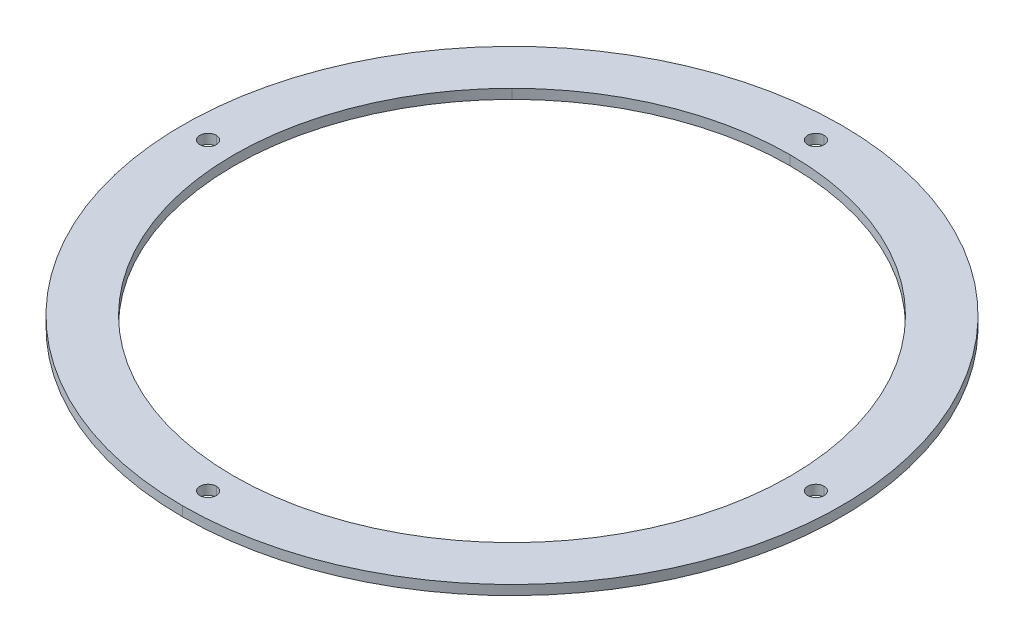
ISO-10303-21;
HEADER;
FILE_DESCRIPTION(('STEP AP214'),'2;1');
FILE_NAME('part.step','',(''),(''),'','','');
FILE_SCHEMA(('AUTOMOTIVE_DESIGN { 1 0 10303 214 1 1 1 1 }'));
ENDSEC;
DATA;
#1=APPLICATION_CONTEXT('core data for automotive mechanical design processes');
#2=APPLICATION_PROTOCOL_DEFINITION('international standard','automotive_design',2000,#1);
#3=PRODUCT_CONTEXT('',#1,'mechanical');
#4=PRODUCT('Part','Part','',(#3));
#5=PRODUCT_RELATED_PRODUCT_CATEGORY('part','',(#4));
#6=PRODUCT_DEFINITION_FORMATION('','',#4);
#7=PRODUCT_DEFINITION_CONTEXT('part definition',#1,'design');
#8=PRODUCT_DEFINITION('design','',#6,#7);
#9=PRODUCT_DEFINITION_SHAPE('','',#8);
#10=(LENGTH_UNIT() NAMED_UNIT(*) SI_UNIT(.MILLI.,.METRE.));
#11=(NAMED_UNIT(*) PLANE_ANGLE_UNIT() SI_UNIT($,.RADIAN.));
#12=(NAMED_UNIT(*) SI_UNIT($,.STERADIAN.) SOLID_ANGLE_UNIT());
#13=UNCERTAINTY_MEASURE_WITH_UNIT(LENGTH_MEASURE(1.E-05),#10,'distance_accuracy_value','');
#14=(GEOMETRIC_REPRESENTATION_CONTEXT(3) GLOBAL_UNCERTAINTY_ASSIGNED_CONTEXT((#13)) GLOBAL_UNIT_ASSIGNED_CONTEXT((#10,
#11,#12)) REPRESENTATION_CONTEXT('',''));
#15=CARTESIAN_POINT('',(0.,0.,0.));
#16=DIRECTION('',(0.,0.,1.));
#17=DIRECTION('',(1.,0.,0.));
#18=AXIS2_PLACEMENT_3D('',#15,#16,#17);
#19=CARTESIAN_POINT('',(0.,0.,0.));
#20=DIRECTION('',(0.,1.,0.));
#21=DIRECTION('',(1.,0.,0.));
#22=AXIS2_PLACEMENT_3D('',#19,#20,#21);
#23=PLANE('',#22);
#24=CARTESIAN_POINT('',(0.,0.,-94.75));
#25=DIRECTION('',(0.,1.,0.));
#26=DIRECTION('',(0.,0.,1.));
#27=AXIS2_PLACEMENT_3D('',#24,#25,#26);
#28=CIRCLE('',#27,2.5527);
#29=CARTESIAN_POINT('',(0.,0.,-97.3027));
#30=VERTEX_POINT('',#29);
#31=CARTESIAN_POINT('',(0.,0.,-92.1973));
#32=VERTEX_POINT('',#31);
#33=EDGE_CURVE('E162',#30,#32,#28,.T.);
#34=ORIENTED_EDGE('',*,*,#33,.T.);
#35=CARTESIAN_POINT('',(0.,0.,-94.75));
#36=DIRECTION('',(0.,1.,0.));
#37=DIRECTION('',(0.,0.,1.));
#38=AXIS2_PLACEMENT_3D('',#35,#36,#37);
#39=CIRCLE('',#38,2.5527);
#40=EDGE_CURVE('E11',#32,#30,#39,.T.);
#41=ORIENTED_EDGE('',*,*,#40,.T.);
#42=EDGE_LOOP('',(#34,#41));
#43=FACE_BOUND('',#42,.T.);
#44=CARTESIAN_POINT('',(-0.001,0.,-0.001));
#45=DIRECTION('',(0.,1.,0.));
#46=DIRECTION('',(0.,0.,1.));
#47=AXIS2_PLACEMENT_3D('',#44,#45,#46);
#48=CIRCLE('',#47,86.75);
#49=CARTESIAN_POINT('',(-61.3420132658952,0.,-61.3430132658953));
#50=VERTEX_POINT('',#49);
#51=CARTESIAN_POINT('',(-61.3420132658953,0.,61.3410132658952));
#52=VERTEX_POINT('',#51);
#53=EDGE_CURVE('E275',#50,#52,#48,.T.);
#54=ORIENTED_EDGE('',*,*,#53,.T.);
#55=CARTESIAN_POINT('',(0.,0.,0.));
#56=DIRECTION('',(0.,1.,0.));
#57=DIRECTION('',(0.,0.,1.));
#58=AXIS2_PLACEMENT_3D('',#55,#56,#57);
#59=CIRCLE('',#58,86.75);
#60=CARTESIAN_POINT('',(61.3420132658951,0.,61.3410132658953));
#61=VERTEX_POINT('',#60);
#62=EDGE_CURVE('E48',#52,#61,#59,.T.);
#63=ORIENTED_EDGE('',*,*,#62,.T.);
#64=CARTESIAN_POINT('',(0.001,0.,-0.001));
#65=DIRECTION('',(0.,1.,0.));
#66=DIRECTION('',(0.,0.,1.));
#67=AXIS2_PLACEMENT_3D('',#64,#65,#66);
#68=CIRCLE('',#67,86.75);
#69=CARTESIAN_POINT('',(61.3420132658953,0.,-61.3430132658951));
#70=VERTEX_POINT('',#69);
#71=EDGE_CURVE('E301',#61,#70,#68,.T.);
#72=ORIENTED_EDGE('',*,*,#71,.T.);
#73=CARTESIAN_POINT('',(0.,0.,-0.002));
#74=DIRECTION('',(0.,1.,0.));
#75=DIRECTION('',(0.,0.,1.));
#76=AXIS2_PLACEMENT_3D('',#73,#74,#75);
#77=CIRCLE('',#76,86.75);
#78=CARTESIAN_POINT('',(0.,0.,-86.752));
#79=VERTEX_POINT('',#78);
#80=EDGE_CURVE('E267',#70,#79,#77,.T.);
#81=ORIENTED_EDGE('',*,*,#80,.T.);
#82=CARTESIAN_POINT('',(0.,0.,-0.002));
#83=DIRECTION('',(0.,1.,0.));
#84=DIRECTION('',(0.,0.,1.));
#85=AXIS2_PLACEMENT_3D('',#82,#83,#84);
#86=CIRCLE('',#85,86.75);
#87=EDGE_CURVE('E296',#79,#50,#86,.T.);
#88=ORIENTED_EDGE('',*,*,#87,.T.);
#89=EDGE_LOOP('',(#54,#63,#72,#81,#88));
#90=FACE_BOUND('',#89,.T.);
#91=CARTESIAN_POINT('',(94.75,0.,0.));
#92=DIRECTION('',(0.,1.,0.));
#93=DIRECTION('',(0.,0.,1.));
#94=AXIS2_PLACEMENT_3D('',#91,#92,#93);
#95=CIRCLE('',#94,2.5527);
#96=CARTESIAN_POINT('',(94.75,0.,-2.5527));
#97=VERTEX_POINT('',#96);
#98=CARTESIAN_POINT('',(94.75,0.,2.5527));
#99=VERTEX_POINT('',#98);
#100=EDGE_CURVE('E251',#97,#99,#95,.T.);
#101=ORIENTED_EDGE('',*,*,#100,.T.);
#102=CARTESIAN_POINT('',(94.75,0.,0.));
#103=DIRECTION('',(0.,1.,0.));
#104=DIRECTION('',(0.,0.,1.));
#105=AXIS2_PLACEMENT_3D('',#102,#103,#104);
#106=CIRCLE('',#105,2.5527);
#107=EDGE_CURVE('E314',#99,#97,#106,.T.);
#108=ORIENTED_EDGE('',*,*,#107,.T.);
#109=EDGE_LOOP('',(#101,#108));
#110=FACE_BOUND('',#109,.T.);
#111=CARTESIAN_POINT('',(0.,0.,94.75));
#112=DIRECTION('',(0.,1.,0.));
#113=DIRECTION('',(0.,0.,1.));
#114=AXIS2_PLACEMENT_3D('',#111,#112,#113);
#115=CIRCLE('',#114,2.5527);
#116=CARTESIAN_POINT('',(0.,0.,92.1973));
#117=VERTEX_POINT('',#116);
#118=CARTESIAN_POINT('',(0.,0.,97.3027));
#119=VERTEX_POINT('',#118);
#120=EDGE_CURVE('E220',#117,#119,#115,.T.);
#121=ORIENTED_EDGE('',*,*,#120,.T.);
#122=CARTESIAN_POINT('',(0.,0.,94.75));
#123=DIRECTION('',(0.,1.,0.));
#124=DIRECTION('',(0.,0.,1.));
#125=AXIS2_PLACEMENT_3D('',#122,#123,#124);
#126=CIRCLE('',#125,2.5527);
#127=EDGE_CURVE('E234',#119,#117,#126,.T.);
#128=ORIENTED_EDGE('',*,*,#127,.T.);
#129=EDGE_LOOP('',(#121,#128));
#130=FACE_BOUND('',#129,.T.);
#131=CARTESIAN_POINT('',(-94.75,0.,0.));
#132=DIRECTION('',(0.,1.,0.));
#133=DIRECTION('',(0.,0.,1.));
#134=AXIS2_PLACEMENT_3D('',#131,#132,#133);
#135=CIRCLE('',#134,2.5527);
#136=CARTESIAN_POINT('',(-94.75,0.,-2.55270000000004));
#137=VERTEX_POINT('',#136);
#138=CARTESIAN_POINT('',(-94.75,0.,2.5527));
#139=VERTEX_POINT('',#138);
#140=EDGE_CURVE('E227',#137,#139,#135,.T.);
#141=ORIENTED_EDGE('',*,*,#140,.T.);
#142=CARTESIAN_POINT('',(-94.75,0.,0.));
#143=DIRECTION('',(0.,1.,0.));
#144=DIRECTION('',(0.,0.,1.));
#145=AXIS2_PLACEMENT_3D('',#142,#143,#144);
#146=CIRCLE('',#145,2.5527);
#147=EDGE_CURVE('E210',#139,#137,#146,.T.);
#148=ORIENTED_EDGE('',*,*,#147,.T.);
#149=EDGE_LOOP('',(#141,#148));
#150=FACE_BOUND('',#149,.T.);
#151=CARTESIAN_POINT('',(0.,0.,0.));
#152=DIRECTION('',(0.,1.,0.));
#153=DIRECTION('',(0.,0.,1.));
#154=AXIS2_PLACEMENT_3D('',#151,#152,#153);
#155=CIRCLE('',#154,102.75);
#156=CARTESIAN_POINT('',(0.,0.,-102.75));
#157=VERTEX_POINT('',#156);
#158=CARTESIAN_POINT('',(0.,0.,102.75));
#159=VERTEX_POINT('',#158);
#160=EDGE_CURVE('E289',#157,#159,#155,.T.);
#161=ORIENTED_EDGE('',*,*,#160,.F.);
#162=CARTESIAN_POINT('',(0.,0.,0.));
#163=DIRECTION('',(0.,1.,0.));
#164=DIRECTION('',(0.,0.,1.));
#165=AXIS2_PLACEMENT_3D('',#162,#163,#164);
#166=CIRCLE('',#165,102.75);
#167=EDGE_CURVE('E190',#159,#157,#166,.T.);
#168=ORIENTED_EDGE('',*,*,#167,.F.);
#169=EDGE_LOOP('',(#161,#168));
#170=FACE_BOUND('',#169,.T.);
#171=ADVANCED_FACE('F16',(#43,#90,#110,#130,#150,#170),#23,.F.);
#172=CARTESIAN_POINT('',(0.,2.9972,0.));
#173=DIRECTION('',(0.,1.,0.));
#174=DIRECTION('',(1.,0.,0.));
#175=AXIS2_PLACEMENT_3D('',#172,#173,#174);
#176=PLANE('',#175);
#177=CARTESIAN_POINT('',(0.,2.9972,-94.75));
#178=DIRECTION('',(0.,1.,0.));
#179=DIRECTION('',(0.,0.,1.));
#180=AXIS2_PLACEMENT_3D('',#177,#178,#179);
#181=CIRCLE('',#180,2.5527);
#182=CARTESIAN_POINT('',(0.,2.9972,-97.3027));
#183=VERTEX_POINT('',#182);
#184=CARTESIAN_POINT('',(0.,2.9972,-92.1973));
#185=VERTEX_POINT('',#184);
#186=EDGE_CURVE('E183',#183,#185,#181,.T.);
#187=ORIENTED_EDGE('',*,*,#186,.F.);
#188=CARTESIAN_POINT('',(0.,2.9972,-94.75));
#189=DIRECTION('',(0.,1.,0.));
#190=DIRECTION('',(0.,0.,1.));
#191=AXIS2_PLACEMENT_3D('',#188,#189,#190);
#192=CIRCLE('',#191,2.5527);
#193=EDGE_CURVE('E24',#185,#183,#192,.T.);
#194=ORIENTED_EDGE('',*,*,#193,.F.);
#195=EDGE_LOOP('',(#187,#194));
#196=FACE_BOUND('',#195,.T.);
#197=CARTESIAN_POINT('',(-0.001,2.9972,-0.001));
#198=DIRECTION('',(0.,1.,0.));
#199=DIRECTION('',(0.,0.,1.));
#200=AXIS2_PLACEMENT_3D('',#197,#198,#199);
#201=CIRCLE('',#200,86.75);
#202=CARTESIAN_POINT('',(-61.3420132658952,2.9972,-61.3430132658953));
#203=VERTEX_POINT('',#202);
#204=CARTESIAN_POINT('',(-61.3420132658953,2.9972,61.3410132658952));
#205=VERTEX_POINT('',#204);
#206=EDGE_CURVE('E282',#203,#205,#201,.T.);
#207=ORIENTED_EDGE('',*,*,#206,.F.);
#208=CARTESIAN_POINT('',(0.,2.9972,-0.002));
#209=DIRECTION('',(0.,1.,0.));
#210=DIRECTION('',(0.,0.,1.));
#211=AXIS2_PLACEMENT_3D('',#208,#209,#210);
#212=CIRCLE('',#211,86.75);
#213=CARTESIAN_POINT('',(0.,2.9972,-86.752));
#214=VERTEX_POINT('',#213);
#215=EDGE_CURVE('E293',#214,#203,#212,.T.);
#216=ORIENTED_EDGE('',*,*,#215,.F.);
#217=CARTESIAN_POINT('',(0.,2.9972,-0.002));
#218=DIRECTION('',(0.,1.,0.));
#219=DIRECTION('',(0.,0.,1.));
#220=AXIS2_PLACEMENT_3D('',#217,#218,#219);
#221=CIRCLE('',#220,86.75);
#222=CARTESIAN_POINT('',(61.3420132658953,2.9972,-61.3430132658951));
#223=VERTEX_POINT('',#222);
#224=EDGE_CURVE('E259',#223,#214,#221,.T.);
#225=ORIENTED_EDGE('',*,*,#224,.F.);
#226=CARTESIAN_POINT('',(0.001,2.9972,-0.001));
#227=DIRECTION('',(0.,1.,0.));
#228=DIRECTION('',(0.,0.,1.));
#229=AXIS2_PLACEMENT_3D('',#226,#227,#228);
#230=CIRCLE('',#229,86.75);
#231=CARTESIAN_POINT('',(61.3420132658951,2.9972,61.3410132658953));
#232=VERTEX_POINT('',#231);
#233=EDGE_CURVE('E307',#232,#223,#230,.T.);
#234=ORIENTED_EDGE('',*,*,#233,.F.);
#235=CARTESIAN_POINT('',(0.,2.9972,0.));
#236=DIRECTION('',(0.,1.,0.));
#237=DIRECTION('',(0.,0.,1.));
#238=AXIS2_PLACEMENT_3D('',#235,#236,#237);
#239=CIRCLE('',#238,86.75);
#240=EDGE_CURVE('E37',#205,#232,#239,.T.);
#241=ORIENTED_EDGE('',*,*,#240,.F.);
#242=EDGE_LOOP('',(#207,#216,#225,#234,#241));
#243=FACE_BOUND('',#242,.T.);
#244=CARTESIAN_POINT('',(94.75,2.9972,0.));
#245=DIRECTION('',(0.,1.,0.));
#246=DIRECTION('',(0.,0.,1.));
#247=AXIS2_PLACEMENT_3D('',#244,#245,#246);
#248=CIRCLE('',#247,2.5527);
#249=CARTESIAN_POINT('',(94.75,2.9972,-2.5527));
#250=VERTEX_POINT('',#249);
#251=CARTESIAN_POINT('',(94.75,2.9972,2.5527));
#252=VERTEX_POINT('',#251);
#253=EDGE_CURVE('E219',#250,#252,#248,.T.);
#254=ORIENTED_EDGE('',*,*,#253,.F.);
#255=CARTESIAN_POINT('',(94.75,2.9972,0.));
#256=DIRECTION('',(0.,1.,0.));
#257=DIRECTION('',(0.,0.,1.));
#258=AXIS2_PLACEMENT_3D('',#255,#256,#257);
#259=CIRCLE('',#258,2.5527);
#260=EDGE_CURVE('E317',#252,#250,#259,.T.);
#261=ORIENTED_EDGE('',*,*,#260,.F.);
#262=EDGE_LOOP('',(#254,#261));
#263=FACE_BOUND('',#262,.T.);
#264=CARTESIAN_POINT('',(0.,2.9972,94.75));
#265=DIRECTION('',(0.,1.,0.));
#266=DIRECTION('',(0.,0.,1.));
#267=AXIS2_PLACEMENT_3D('',#264,#265,#266);
#268=CIRCLE('',#267,2.5527);
#269=CARTESIAN_POINT('',(0.,2.9972,92.1973));
#270=VERTEX_POINT('',#269);
#271=CARTESIAN_POINT('',(0.,2.9972,97.3027));
#272=VERTEX_POINT('',#271);
#273=EDGE_CURVE('E201',#270,#272,#268,.T.);
#274=ORIENTED_EDGE('',*,*,#273,.F.);
#275=CARTESIAN_POINT('',(0.,2.9972,94.75));
#276=DIRECTION('',(0.,1.,0.));
#277=DIRECTION('',(0.,0.,1.));
#278=AXIS2_PLACEMENT_3D('',#275,#276,#277);
#279=CIRCLE('',#278,2.5527);
#280=EDGE_CURVE('E237',#272,#270,#279,.T.);
#281=ORIENTED_EDGE('',*,*,#280,.F.);
#282=EDGE_LOOP('',(#274,#281));
#283=FACE_BOUND('',#282,.T.);
#284=CARTESIAN_POINT('',(-94.75,2.9972,0.));
#285=DIRECTION('',(0.,1.,0.));
#286=DIRECTION('',(0.,0.,1.));
#287=AXIS2_PLACEMENT_3D('',#284,#285,#286);
#288=CIRCLE('',#287,2.5527);
#289=CARTESIAN_POINT('',(-94.75,2.9972,-2.55270000000004));
#290=VERTEX_POINT('',#289);
#291=CARTESIAN_POINT('',(-94.75,2.9972,2.5527));
#292=VERTEX_POINT('',#291);
#293=EDGE_CURVE('E192',#290,#292,#288,.T.);
#294=ORIENTED_EDGE('',*,*,#293,.F.);
#295=CARTESIAN_POINT('',(-94.75,2.9972,0.));
#296=DIRECTION('',(0.,1.,0.));
#297=DIRECTION('',(0.,0.,1.));
#298=AXIS2_PLACEMENT_3D('',#295,#296,#297);
#299=CIRCLE('',#298,2.5527);
#300=EDGE_CURVE('E214',#292,#290,#299,.T.);
#301=ORIENTED_EDGE('',*,*,#300,.F.);
#302=EDGE_LOOP('',(#294,#301));
#303=FACE_BOUND('',#302,.T.);
#304=CARTESIAN_POINT('',(0.,2.9972,0.));
#305=DIRECTION('',(0.,1.,0.));
#306=DIRECTION('',(0.,0.,1.));
#307=AXIS2_PLACEMENT_3D('',#304,#305,#306);
#308=CIRCLE('',#307,102.75);
#309=CARTESIAN_POINT('',(0.,2.9972,-102.75));
#310=VERTEX_POINT('',#309);
#311=CARTESIAN_POINT('',(0.,2.9972,102.75));
#312=VERTEX_POINT('',#311);
#313=EDGE_CURVE('E213',#310,#312,#308,.T.);
#314=ORIENTED_EDGE('',*,*,#313,.T.);
#315=CARTESIAN_POINT('',(0.,2.9972,0.));
#316=DIRECTION('',(0.,1.,0.));
#317=DIRECTION('',(0.,0.,1.));
#318=AXIS2_PLACEMENT_3D('',#315,#316,#317);
#319=CIRCLE('',#318,102.75);
#320=EDGE_CURVE('E173',#312,#310,#319,.T.);
#321=ORIENTED_EDGE('',*,*,#320,.T.);
#322=EDGE_LOOP('',(#314,#321));
#323=FACE_BOUND('',#322,.T.);
#324=ADVANCED_FACE('F336',(#196,#243,#263,#283,#303,#323),#176,.T.);
#325=CARTESIAN_POINT('',(0.,2.9972,-94.75));
#326=DIRECTION('',(0.,-1.,0.));
#327=DIRECTION('',(0.,0.,-1.));
#328=AXIS2_PLACEMENT_3D('',#325,#326,#327);
#329=CYLINDRICAL_SURFACE('',#328,2.5527);
#330=DIRECTION('',(0.,-1.,0.));
#331=VECTOR('',#330,1.);
#332=CARTESIAN_POINT('',(0.,2.9972,-92.1973));
#333=LINE('',#332,#331);
#334=EDGE_CURVE('E176',#185,#32,#333,.T.);
#335=ORIENTED_EDGE('',*,*,#334,.F.);
#336=ORIENTED_EDGE('',*,*,#193,.T.);
#337=DIRECTION('',(0.,-1.,0.));
#338=VECTOR('',#337,1.);
#339=CARTESIAN_POINT('',(0.,2.9972,-97.3027));
#340=LINE('',#339,#338);
#341=EDGE_CURVE('E167',#183,#30,#340,.T.);
#342=ORIENTED_EDGE('',*,*,#341,.T.);
#343=ORIENTED_EDGE('',*,*,#40,.F.);
#344=EDGE_LOOP('',(#335,#336,#342,#343));
#345=FACE_BOUND('',#344,.T.);
#346=ADVANCED_FACE('F168',(#345),#329,.F.);
#347=CARTESIAN_POINT('',(0.,2.9972,0.));
#348=DIRECTION('',(0.,-1.,0.));
#349=DIRECTION('',(0.,0.,-1.));
#350=AXIS2_PLACEMENT_3D('',#347,#348,#349);
#351=CYLINDRICAL_SURFACE('',#350,102.75);
#352=DIRECTION('',(0.,-1.,0.));
#353=VECTOR('',#352,1.);
#354=CARTESIAN_POINT('',(0.,2.9972,102.75));
#355=LINE('',#354,#353);
#356=EDGE_CURVE('E187',#312,#159,#355,.T.);
#357=ORIENTED_EDGE('',*,*,#356,.F.);
#358=ORIENTED_EDGE('',*,*,#313,.F.);
#359=DIRECTION('',(0.,-1.,0.));
#360=VECTOR('',#359,1.);
#361=CARTESIAN_POINT('',(0.,2.9972,-102.75));
#362=LINE('',#361,#360);
#363=EDGE_CURVE('E197',#310,#157,#362,.T.);
#364=ORIENTED_EDGE('',*,*,#363,.T.);
#365=ORIENTED_EDGE('',*,*,#160,.T.);
#366=EDGE_LOOP('',(#357,#358,#364,#365));
#367=FACE_BOUND('',#366,.T.);
#368=ADVANCED_FACE('F329',(#367),#351,.T.);
#369=CARTESIAN_POINT('',(-94.75,2.9972,0.));
#370=DIRECTION('',(0.,-1.,0.));
#371=DIRECTION('',(0.,0.,-1.));
#372=AXIS2_PLACEMENT_3D('',#369,#370,#371);
#373=CYLINDRICAL_SURFACE('',#372,2.5527);
#374=DIRECTION('',(0.,-1.,0.));
#375=VECTOR('',#374,1.);
#376=CARTESIAN_POINT('',(-94.75,2.9972,2.5527));
#377=LINE('',#376,#375);
#378=EDGE_CURVE('E196',#292,#139,#377,.T.);
#379=ORIENTED_EDGE('',*,*,#378,.F.);
#380=ORIENTED_EDGE('',*,*,#300,.T.);
#381=DIRECTION('',(0.,-1.,0.));
#382=VECTOR('',#381,1.);
#383=CARTESIAN_POINT('',(-94.75,2.9972,-2.55270000000004));
#384=LINE('',#383,#382);
#385=EDGE_CURVE('E206',#290,#137,#384,.T.);
#386=ORIENTED_EDGE('',*,*,#385,.T.);
#387=ORIENTED_EDGE('',*,*,#147,.F.);
#388=EDGE_LOOP('',(#379,#380,#386,#387));
#389=FACE_BOUND('',#388,.T.);
#390=ADVANCED_FACE('F366',(#389),#373,.F.);
#391=CARTESIAN_POINT('',(0.,2.9972,94.75));
#392=DIRECTION('',(0.,-1.,0.));
#393=DIRECTION('',(0.,0.,-1.));
#394=AXIS2_PLACEMENT_3D('',#391,#392,#393);
#395=CYLINDRICAL_SURFACE('',#394,2.5527);
#396=DIRECTION('',(0.,-1.,0.));
#397=VECTOR('',#396,1.);
#398=CARTESIAN_POINT('',(0.,2.9972,97.3027));
#399=LINE('',#398,#397);
#400=EDGE_CURVE('E205',#272,#119,#399,.T.);
#401=ORIENTED_EDGE('',*,*,#400,.F.);
#402=ORIENTED_EDGE('',*,*,#280,.T.);
#403=DIRECTION('',(0.,-1.,0.));
#404=VECTOR('',#403,1.);
#405=CARTESIAN_POINT('',(0.,2.9972,92.1973));
#406=LINE('',#405,#404);
#407=EDGE_CURVE('E215',#270,#117,#406,.T.);
#408=ORIENTED_EDGE('',*,*,#407,.T.);
#409=ORIENTED_EDGE('',*,*,#127,.F.);
#410=EDGE_LOOP('',(#401,#402,#408,#409));
#411=FACE_BOUND('',#410,.T.);
#412=ADVANCED_FACE('F370',(#411),#395,.F.);
#413=CARTESIAN_POINT('',(94.75,2.9972,0.));
#414=DIRECTION('',(0.,-1.,0.));
#415=DIRECTION('',(0.,0.,-1.));
#416=AXIS2_PLACEMENT_3D('',#413,#414,#415);
#417=CYLINDRICAL_SURFACE('',#416,2.5527);
#418=DIRECTION('',(0.,-1.,0.));
#419=VECTOR('',#418,1.);
#420=CARTESIAN_POINT('',(94.75,2.9972,2.5527));
#421=LINE('',#420,#419);
#422=EDGE_CURVE('E247',#252,#99,#421,.T.);
#423=ORIENTED_EDGE('',*,*,#422,.F.);
#424=ORIENTED_EDGE('',*,*,#260,.T.);
#425=DIRECTION('',(0.,-1.,0.));
#426=VECTOR('',#425,1.);
#427=CARTESIAN_POINT('',(94.75,2.9972,-2.5527));
#428=LINE('',#427,#426);
#429=EDGE_CURVE('E255',#250,#97,#428,.T.);
#430=ORIENTED_EDGE('',*,*,#429,.T.);
#431=ORIENTED_EDGE('',*,*,#107,.F.);
#432=EDGE_LOOP('',(#423,#424,#430,#431));
#433=FACE_BOUND('',#432,.T.);
#434=ADVANCED_FACE('F369',(#433),#417,.F.);
#435=CARTESIAN_POINT('',(0.,2.9972,0.));
#436=DIRECTION('',(0.,-1.,0.));
#437=DIRECTION('',(0.,0.,-1.));
#438=AXIS2_PLACEMENT_3D('',#435,#436,#437);
#439=CYLINDRICAL_SURFACE('',#438,86.75);
#440=ORIENTED_EDGE('',*,*,#62,.F.);
#441=DIRECTION('',(0.,-1.,0.));
#442=VECTOR('',#441,1.);
#443=CARTESIAN_POINT('',(-61.3420132658953,2.9972,61.3410132658952));
#444=LINE('',#443,#442);
#445=EDGE_CURVE('E286',#205,#52,#444,.T.);
#446=ORIENTED_EDGE('',*,*,#445,.F.);
#447=ORIENTED_EDGE('',*,*,#240,.T.);
#448=DIRECTION('',(0.,-1.,0.));
#449=VECTOR('',#448,1.);
#450=CARTESIAN_POINT('',(61.3420132658951,2.9972,61.3410132658953));
#451=LINE('',#450,#449);
#452=EDGE_CURVE('E304',#232,#61,#451,.T.);
#453=ORIENTED_EDGE('',*,*,#452,.T.);
#454=EDGE_LOOP('',(#440,#446,#447,#453));
#455=FACE_BOUND('',#454,.T.);
#456=ADVANCED_FACE('F359',(#455),#439,.F.);
#457=CARTESIAN_POINT('',(0.001,2.9972,-0.001));
#458=DIRECTION('',(0.,-1.,0.));
#459=DIRECTION('',(0.,0.,-1.));
#460=AXIS2_PLACEMENT_3D('',#457,#458,#459);
#461=CYLINDRICAL_SURFACE('',#460,86.75);
#462=ORIENTED_EDGE('',*,*,#71,.F.);
#463=ORIENTED_EDGE('',*,*,#452,.F.);
#464=ORIENTED_EDGE('',*,*,#233,.T.);
#465=DIRECTION('',(0.,-1.,0.));
#466=VECTOR('',#465,1.);
#467=CARTESIAN_POINT('',(61.3420132658953,2.9972,-61.3430132658951));
#468=LINE('',#467,#466);
#469=EDGE_CURVE('E271',#223,#70,#468,.T.);
#470=ORIENTED_EDGE('',*,*,#469,.T.);
#471=EDGE_LOOP('',(#462,#463,#464,#470));
#472=FACE_BOUND('',#471,.T.);
#473=ADVANCED_FACE('F356',(#472),#461,.F.);
#474=CARTESIAN_POINT('',(0.,2.9972,-0.002));
#475=DIRECTION('',(0.,-1.,0.));
#476=DIRECTION('',(0.,0.,-1.));
#477=AXIS2_PLACEMENT_3D('',#474,#475,#476);
#478=CYLINDRICAL_SURFACE('',#477,86.75);
#479=DIRECTION('',(0.,-1.,0.));
#480=VECTOR('',#479,1.);
#481=CARTESIAN_POINT('',(0.,2.9972,-86.752));
#482=LINE('',#481,#480);
#483=EDGE_CURVE('E263',#214,#79,#482,.T.);
#484=ORIENTED_EDGE('',*,*,#483,.F.);
#485=ORIENTED_EDGE('',*,*,#215,.T.);
#486=DIRECTION('',(0.,-1.,0.));
#487=VECTOR('',#486,1.);
#488=CARTESIAN_POINT('',(-61.3420132658952,2.9972,-61.3430132658953));
#489=LINE('',#488,#487);
#490=EDGE_CURVE('E278',#203,#50,#489,.T.);
#491=ORIENTED_EDGE('',*,*,#490,.T.);
#492=ORIENTED_EDGE('',*,*,#87,.F.);
#493=EDGE_LOOP('',(#484,#485,#491,#492));
#494=FACE_BOUND('',#493,.T.);
#495=ADVANCED_FACE('F354',(#494),#478,.F.);
#496=CARTESIAN_POINT('',(-0.001,2.9972,-0.001));
#497=DIRECTION('',(0.,-1.,0.));
#498=DIRECTION('',(0.,0.,-1.));
#499=AXIS2_PLACEMENT_3D('',#496,#497,#498);
#500=CYLINDRICAL_SURFACE('',#499,86.75);
#501=ORIENTED_EDGE('',*,*,#53,.F.);
#502=ORIENTED_EDGE('',*,*,#490,.F.);
#503=ORIENTED_EDGE('',*,*,#206,.T.);
#504=ORIENTED_EDGE('',*,*,#445,.T.);
#505=EDGE_LOOP('',(#501,#502,#503,#504));
#506=FACE_BOUND('',#505,.T.);
#507=ADVANCED_FACE('F350',(#506),#500,.F.);
#508=CARTESIAN_POINT('',(0.,2.9972,-0.002));
#509=DIRECTION('',(0.,-1.,0.));
#510=DIRECTION('',(0.,0.,-1.));
#511=AXIS2_PLACEMENT_3D('',#508,#509,#510);
#512=CYLINDRICAL_SURFACE('',#511,86.75);
#513=ORIENTED_EDGE('',*,*,#224,.T.);
#514=ORIENTED_EDGE('',*,*,#483,.T.);
#515=ORIENTED_EDGE('',*,*,#80,.F.);
#516=ORIENTED_EDGE('',*,*,#469,.F.);
#517=EDGE_LOOP('',(#513,#514,#515,#516));
#518=FACE_BOUND('',#517,.T.);
#519=ADVANCED_FACE('F353',(#518),#512,.F.);
#520=CARTESIAN_POINT('',(94.75,2.9972,0.));
#521=DIRECTION('',(0.,-1.,0.));
#522=DIRECTION('',(0.,0.,-1.));
#523=AXIS2_PLACEMENT_3D('',#520,#521,#522);
#524=CYLINDRICAL_SURFACE('',#523,2.5527);
#525=ORIENTED_EDGE('',*,*,#253,.T.);
#526=ORIENTED_EDGE('',*,*,#422,.T.);
#527=ORIENTED_EDGE('',*,*,#100,.F.);
#528=ORIENTED_EDGE('',*,*,#429,.F.);
#529=EDGE_LOOP('',(#525,#526,#527,#528));
#530=FACE_BOUND('',#529,.T.);
#531=ADVANCED_FACE('F395',(#530),#524,.F.);
#532=CARTESIAN_POINT('',(0.,2.9972,94.75));
#533=DIRECTION('',(0.,-1.,0.));
#534=DIRECTION('',(0.,0.,-1.));
#535=AXIS2_PLACEMENT_3D('',#532,#533,#534);
#536=CYLINDRICAL_SURFACE('',#535,2.5527);
#537=ORIENTED_EDGE('',*,*,#273,.T.);
#538=ORIENTED_EDGE('',*,*,#400,.T.);
#539=ORIENTED_EDGE('',*,*,#120,.F.);
#540=ORIENTED_EDGE('',*,*,#407,.F.);
#541=EDGE_LOOP('',(#537,#538,#539,#540));
#542=FACE_BOUND('',#541,.T.);
#543=ADVANCED_FACE('F387',(#542),#536,.F.);
#544=CARTESIAN_POINT('',(-94.75,2.9972,0.));
#545=DIRECTION('',(0.,-1.,0.));
#546=DIRECTION('',(0.,0.,-1.));
#547=AXIS2_PLACEMENT_3D('',#544,#545,#546);
#548=CYLINDRICAL_SURFACE('',#547,2.5527);
#549=ORIENTED_EDGE('',*,*,#293,.T.);
#550=ORIENTED_EDGE('',*,*,#378,.T.);
#551=ORIENTED_EDGE('',*,*,#140,.F.);
#552=ORIENTED_EDGE('',*,*,#385,.F.);
#553=EDGE_LOOP('',(#549,#550,#551,#552));
#554=FACE_BOUND('',#553,.T.);
#555=ADVANCED_FACE('F383',(#554),#548,.F.);
#556=CARTESIAN_POINT('',(0.,2.9972,0.));
#557=DIRECTION('',(0.,-1.,0.));
#558=DIRECTION('',(0.,0.,-1.));
#559=AXIS2_PLACEMENT_3D('',#556,#557,#558);
#560=CYLINDRICAL_SURFACE('',#559,102.75);
#561=ORIENTED_EDGE('',*,*,#320,.F.);
#562=ORIENTED_EDGE('',*,*,#356,.T.);
#563=ORIENTED_EDGE('',*,*,#167,.T.);
#564=ORIENTED_EDGE('',*,*,#363,.F.);
#565=EDGE_LOOP('',(#561,#562,#563,#564));
#566=FACE_BOUND('',#565,.T.);
#567=ADVANCED_FACE('F334',(#566),#560,.T.);
#568=CARTESIAN_POINT('',(0.,2.9972,-94.75));
#569=DIRECTION('',(0.,-1.,0.));
#570=DIRECTION('',(0.,0.,-1.));
#571=AXIS2_PLACEMENT_3D('',#568,#569,#570);
#572=CYLINDRICAL_SURFACE('',#571,2.5527);
#573=ORIENTED_EDGE('',*,*,#186,.T.);
#574=ORIENTED_EDGE('',*,*,#334,.T.);
#575=ORIENTED_EDGE('',*,*,#33,.F.);
#576=ORIENTED_EDGE('',*,*,#341,.F.);
#577=EDGE_LOOP('',(#573,#574,#575,#576));
#578=FACE_BOUND('',#577,.T.);
#579=ADVANCED_FACE('F175',(#578),#572,.F.);
#580=CLOSED_SHELL('',(#171,#324,#346,#368,#390,#412,#434,#456,#473,#495,#507,#519,#531,#543,
#555,#567,#579));
#581=MANIFOLD_SOLID_BREP('B1',#580);
#582=ADVANCED_BREP_SHAPE_REPRESENTATION('',(#18,#581),#14);
#583=SHAPE_DEFINITION_REPRESENTATION(#9,#582);
ENDSEC;
END-ISO-10303-21;
